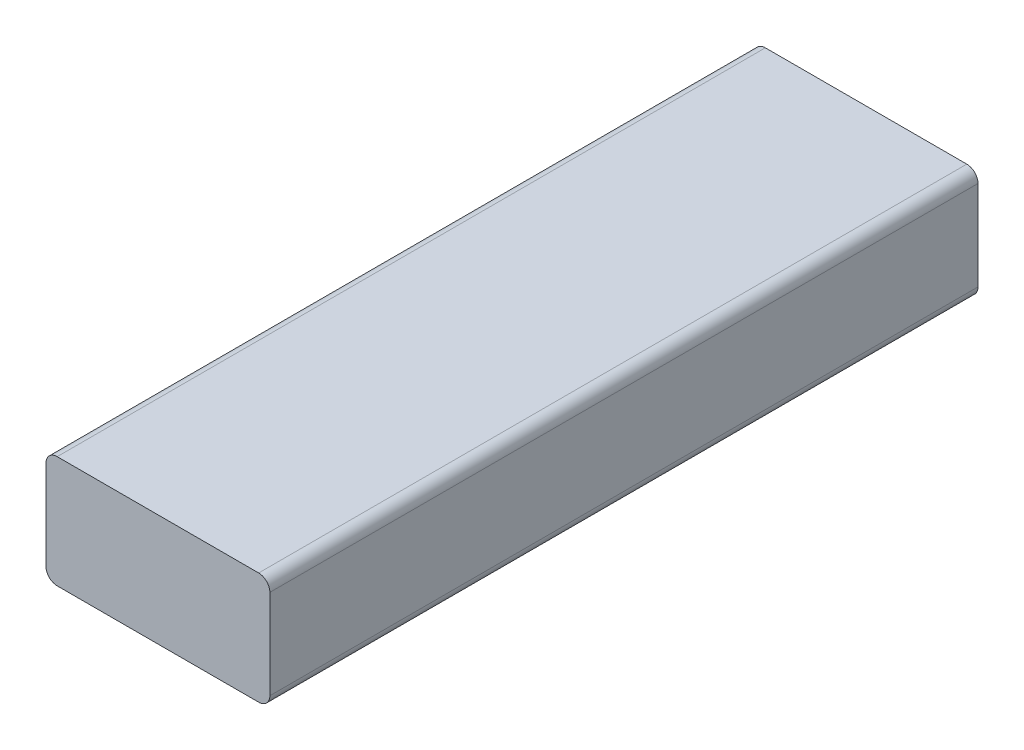
ISO-10303-21;
HEADER;
FILE_DESCRIPTION(('STEP AP214'),'2;1');
FILE_NAME('part.step','',(''),(''),'','','');
FILE_SCHEMA(('AUTOMOTIVE_DESIGN { 1 0 10303 214 1 1 1 1 }'));
ENDSEC;
DATA;
#1=APPLICATION_CONTEXT('core data for automotive mechanical design processes');
#2=APPLICATION_PROTOCOL_DEFINITION('international standard','automotive_design',2000,#1);
#3=PRODUCT_CONTEXT('',#1,'mechanical');
#4=PRODUCT('Part','Part','',(#3));
#5=PRODUCT_RELATED_PRODUCT_CATEGORY('part','',(#4));
#6=PRODUCT_DEFINITION_FORMATION('','',#4);
#7=PRODUCT_DEFINITION_CONTEXT('part definition',#1,'design');
#8=PRODUCT_DEFINITION('design','',#6,#7);
#9=PRODUCT_DEFINITION_SHAPE('','',#8);
#10=(LENGTH_UNIT() NAMED_UNIT(*) SI_UNIT(.MILLI.,.METRE.));
#11=(NAMED_UNIT(*) PLANE_ANGLE_UNIT() SI_UNIT($,.RADIAN.));
#12=(NAMED_UNIT(*) SI_UNIT($,.STERADIAN.) SOLID_ANGLE_UNIT());
#13=UNCERTAINTY_MEASURE_WITH_UNIT(LENGTH_MEASURE(1.E-05),#10,'distance_accuracy_value','');
#14=(GEOMETRIC_REPRESENTATION_CONTEXT(3) GLOBAL_UNCERTAINTY_ASSIGNED_CONTEXT((#13)) GLOBAL_UNIT_ASSIGNED_CONTEXT((#10,
#11,#12)) REPRESENTATION_CONTEXT('',''));
#15=CARTESIAN_POINT('',(0.,0.,0.));
#16=DIRECTION('',(0.,0.,1.));
#17=DIRECTION('',(1.,0.,0.));
#18=AXIS2_PLACEMENT_3D('',#15,#16,#17);
#19=CARTESIAN_POINT('',(2587.29999999996,38.100000000002,-160.699999999997));
#20=DIRECTION('',(1.,0.,0.));
#21=DIRECTION('',(0.,1.,0.));
#22=AXIS2_PLACEMENT_3D('',#19,#20,#21);
#23=PLANE('',#22);
#24=DIRECTION('',(0.,-1.,0.));
#25=VECTOR('',#24,1.);
#26=CARTESIAN_POINT('',(2587.29999999996,38.1000000000078,160.700000000008));
#27=LINE('',#26,#25);
#28=CARTESIAN_POINT('',(2587.29999999996,33.0200000000078,160.700000000008));
#29=VERTEX_POINT('',#28);
#30=CARTESIAN_POINT('',(2587.29999999996,-7.61999999999216,160.700000000009));
#31=VERTEX_POINT('',#30);
#32=EDGE_CURVE('E158',#29,#31,#27,.T.);
#33=ORIENTED_EDGE('',*,*,#32,.T.);
#34=DIRECTION('',(0.,0.,1.));
#35=VECTOR('',#34,1.);
#36=CARTESIAN_POINT('',(2587.29999999996,-7.61999999999798,-160.699999999996));
#37=LINE('',#36,#35);
#38=CARTESIAN_POINT('',(2587.29999999996,-7.61999999999798,-160.699999999996));
#39=VERTEX_POINT('',#38);
#40=EDGE_CURVE('E113',#31,#39,#37,.F.);
#41=ORIENTED_EDGE('',*,*,#40,.T.);
#42=DIRECTION('',(0.,-1.,0.));
#43=VECTOR('',#42,1.);
#44=CARTESIAN_POINT('',(2587.29999999996,38.100000000002,-160.699999999997));
#45=LINE('',#44,#43);
#46=CARTESIAN_POINT('',(2587.29999999996,33.020000000002,-160.699999999996));
#47=VERTEX_POINT('',#46);
#48=EDGE_CURVE('E147',#47,#39,#45,.T.);
#49=ORIENTED_EDGE('',*,*,#48,.F.);
#50=DIRECTION('',(0.,0.,1.));
#51=VECTOR('',#50,1.);
#52=CARTESIAN_POINT('',(2587.29999999996,33.0200000000078,160.700000000008));
#53=LINE('',#52,#51);
#54=EDGE_CURVE('E119',#47,#29,#53,.T.);
#55=ORIENTED_EDGE('',*,*,#54,.T.);
#56=EDGE_LOOP('',(#33,#41,#49,#55));
#57=FACE_BOUND('',#56,.T.);
#58=ADVANCED_FACE('F43',(#57),#23,.T.);
#59=CARTESIAN_POINT('',(2587.29999999996,38.100000000002,-160.699999999997));
#60=DIRECTION('',(0.,0.,-1.));
#61=DIRECTION('',(0.,1.,0.));
#62=AXIS2_PLACEMENT_3D('',#59,#60,#61);
#63=PLANE('',#62);
#64=ORIENTED_EDGE('',*,*,#48,.T.);
#65=CARTESIAN_POINT('',(2582.21999999996,-7.619999999998,-160.699999999996));
#66=DIRECTION('',(0.,0.,-1.));
#67=DIRECTION('',(0.,1.,0.));
#68=AXIS2_PLACEMENT_3D('',#65,#66,#67);
#69=CIRCLE('',#68,5.08);
#70=CARTESIAN_POINT('',(2582.21999999996,-12.699999999998,-160.699999999996));
#71=VERTEX_POINT('',#70);
#72=EDGE_CURVE('E183',#39,#71,#69,.T.);
#73=ORIENTED_EDGE('',*,*,#72,.T.);
#74=DIRECTION('',(1.,0.,0.));
#75=VECTOR('',#74,1.);
#76=CARTESIAN_POINT('',(2587.29999999996,-12.699999999998,-160.699999999996));
#77=LINE('',#76,#75);
#78=CARTESIAN_POINT('',(2490.77999999996,-12.6999999999985,-160.699999999996));
#79=VERTEX_POINT('',#78);
#80=EDGE_CURVE('E130',#79,#71,#77,.T.);
#81=ORIENTED_EDGE('',*,*,#80,.F.);
#82=CARTESIAN_POINT('',(2490.77999999996,-7.61999999999848,-160.699999999996));
#83=DIRECTION('',(0.,0.,-1.));
#84=DIRECTION('',(0.,1.,0.));
#85=AXIS2_PLACEMENT_3D('',#82,#83,#84);
#86=CIRCLE('',#85,5.08);
#87=CARTESIAN_POINT('',(2485.69999999996,-7.6199999999985,-160.699999999996));
#88=VERTEX_POINT('',#87);
#89=EDGE_CURVE('E180',#79,#88,#86,.T.);
#90=ORIENTED_EDGE('',*,*,#89,.T.);
#91=DIRECTION('',(0.,-1.,0.));
#92=VECTOR('',#91,1.);
#93=CARTESIAN_POINT('',(2485.69999999996,38.1000000000015,-160.699999999997));
#94=LINE('',#93,#92);
#95=CARTESIAN_POINT('',(2485.69999999996,33.0200000000015,-160.699999999996));
#96=VERTEX_POINT('',#95);
#97=EDGE_CURVE('E151',#96,#88,#94,.T.);
#98=ORIENTED_EDGE('',*,*,#97,.F.);
#99=CARTESIAN_POINT('',(2490.77999999996,33.0200000000015,-160.699999999996));
#100=DIRECTION('',(0.,0.,-1.));
#101=DIRECTION('',(0.,1.,0.));
#102=AXIS2_PLACEMENT_3D('',#99,#100,#101);
#103=CIRCLE('',#102,5.08);
#104=CARTESIAN_POINT('',(2490.77999999996,38.1000000000015,-160.699999999997));
#105=VERTEX_POINT('',#104);
#106=EDGE_CURVE('E64',#96,#105,#103,.T.);
#107=ORIENTED_EDGE('',*,*,#106,.T.);
#108=DIRECTION('',(1.,0.,0.));
#109=VECTOR('',#108,1.);
#110=CARTESIAN_POINT('',(2587.29999999996,38.100000000002,-160.699999999997));
#111=LINE('',#110,#109);
#112=CARTESIAN_POINT('',(2582.21999999996,38.100000000002,-160.699999999997));
#113=VERTEX_POINT('',#112);
#114=EDGE_CURVE('E144',#105,#113,#111,.T.);
#115=ORIENTED_EDGE('',*,*,#114,.T.);
#116=CARTESIAN_POINT('',(2582.21999999996,33.020000000002,-160.699999999996));
#117=DIRECTION('',(0.,0.,-1.));
#118=DIRECTION('',(0.,1.,0.));
#119=AXIS2_PLACEMENT_3D('',#116,#117,#118);
#120=CIRCLE('',#119,5.08);
#121=EDGE_CURVE('E177',#113,#47,#120,.T.);
#122=ORIENTED_EDGE('',*,*,#121,.T.);
#123=EDGE_LOOP('',(#64,#73,#81,#90,#98,#107,#115,#122));
#124=FACE_BOUND('',#123,.T.);
#125=ADVANCED_FACE('F204',(#124),#63,.T.);
#126=CARTESIAN_POINT('',(2485.69999999996,38.1000000000015,-160.699999999997));
#127=DIRECTION('',(-1.,0.,0.));
#128=DIRECTION('',(0.,-1.,0.));
#129=AXIS2_PLACEMENT_3D('',#126,#127,#128);
#130=PLANE('',#129);
#131=ORIENTED_EDGE('',*,*,#97,.T.);
#132=DIRECTION('',(0.,0.,-1.));
#133=VECTOR('',#132,1.);
#134=CARTESIAN_POINT('',(2485.69999999996,-7.6199999999985,-160.699999999996));
#135=LINE('',#134,#133);
#136=CARTESIAN_POINT('',(2485.69999999996,-7.61999999999269,160.700000000009));
#137=VERTEX_POINT('',#136);
#138=EDGE_CURVE('E190',#88,#137,#135,.F.);
#139=ORIENTED_EDGE('',*,*,#138,.T.);
#140=DIRECTION('',(0.,-1.,0.));
#141=VECTOR('',#140,1.);
#142=CARTESIAN_POINT('',(2485.69999999996,38.1000000000073,160.700000000008));
#143=LINE('',#142,#141);
#144=CARTESIAN_POINT('',(2485.69999999996,33.0200000000073,160.700000000008));
#145=VERTEX_POINT('',#144);
#146=EDGE_CURVE('E155',#145,#137,#143,.T.);
#147=ORIENTED_EDGE('',*,*,#146,.F.);
#148=DIRECTION('',(0.,0.,-1.));
#149=VECTOR('',#148,1.);
#150=CARTESIAN_POINT('',(2485.69999999996,33.0200000000015,-160.699999999996));
#151=LINE('',#150,#149);
#152=EDGE_CURVE('E186',#145,#96,#151,.T.);
#153=ORIENTED_EDGE('',*,*,#152,.T.);
#154=EDGE_LOOP('',(#131,#139,#147,#153));
#155=FACE_BOUND('',#154,.T.);
#156=ADVANCED_FACE('F202',(#155),#130,.T.);
#157=CARTESIAN_POINT('',(2587.29999999996,38.1000000000078,160.700000000008));
#158=DIRECTION('',(0.,0.,1.));
#159=DIRECTION('',(0.,-1.,0.));
#160=AXIS2_PLACEMENT_3D('',#157,#158,#159);
#161=PLANE('',#160);
#162=DIRECTION('',(-1.,0.,0.));
#163=VECTOR('',#162,1.);
#164=CARTESIAN_POINT('',(2587.29999999996,-12.6999999999922,160.700000000009));
#165=LINE('',#164,#163);
#166=CARTESIAN_POINT('',(2582.21999999996,-12.6999999999922,160.700000000009));
#167=VERTEX_POINT('',#166);
#168=CARTESIAN_POINT('',(2490.77999999996,-12.6999999999927,160.700000000009));
#169=VERTEX_POINT('',#168);
#170=EDGE_CURVE('E127',#167,#169,#165,.T.);
#171=ORIENTED_EDGE('',*,*,#170,.F.);
#172=CARTESIAN_POINT('',(2582.21999999996,-7.61999999999219,160.700000000009));
#173=DIRECTION('',(0.,0.,1.));
#174=DIRECTION('',(0.,-1.,0.));
#175=AXIS2_PLACEMENT_3D('',#172,#173,#174);
#176=CIRCLE('',#175,5.08);
#177=EDGE_CURVE('E108',#167,#31,#176,.T.);
#178=ORIENTED_EDGE('',*,*,#177,.T.);
#179=ORIENTED_EDGE('',*,*,#32,.F.);
#180=CARTESIAN_POINT('',(2582.21999999996,33.0200000000078,160.700000000008));
#181=DIRECTION('',(0.,0.,1.));
#182=DIRECTION('',(0.,-1.,0.));
#183=AXIS2_PLACEMENT_3D('',#180,#181,#182);
#184=CIRCLE('',#183,5.08);
#185=CARTESIAN_POINT('',(2582.21999999996,38.1000000000078,160.700000000008));
#186=VERTEX_POINT('',#185);
#187=EDGE_CURVE('E165',#29,#186,#184,.T.);
#188=ORIENTED_EDGE('',*,*,#187,.T.);
#189=DIRECTION('',(-1.,0.,0.));
#190=VECTOR('',#189,1.);
#191=CARTESIAN_POINT('',(2587.29999999996,38.1000000000078,160.700000000008));
#192=LINE('',#191,#190);
#193=CARTESIAN_POINT('',(2490.77999999996,38.1000000000073,160.700000000008));
#194=VERTEX_POINT('',#193);
#195=EDGE_CURVE('E141',#186,#194,#192,.T.);
#196=ORIENTED_EDGE('',*,*,#195,.T.);
#197=CARTESIAN_POINT('',(2490.77999999996,33.0200000000073,160.700000000008));
#198=DIRECTION('',(0.,0.,1.));
#199=DIRECTION('',(0.,-1.,0.));
#200=AXIS2_PLACEMENT_3D('',#197,#198,#199);
#201=CIRCLE('',#200,5.08);
#202=EDGE_CURVE('E132',#194,#145,#201,.T.);
#203=ORIENTED_EDGE('',*,*,#202,.T.);
#204=ORIENTED_EDGE('',*,*,#146,.T.);
#205=CARTESIAN_POINT('',(2490.77999999996,-7.61999999999266,160.700000000009));
#206=DIRECTION('',(0.,0.,1.));
#207=DIRECTION('',(0.,-1.,0.));
#208=AXIS2_PLACEMENT_3D('',#205,#206,#207);
#209=CIRCLE('',#208,5.08);
#210=EDGE_CURVE('E120',#137,#169,#209,.T.);
#211=ORIENTED_EDGE('',*,*,#210,.T.);
#212=EDGE_LOOP('',(#171,#178,#179,#188,#196,#203,#204,#211));
#213=FACE_BOUND('',#212,.T.);
#214=ADVANCED_FACE('F135',(#213),#161,.T.);
#215=CARTESIAN_POINT('',(-1.99258099982953E-13,38.0999999999914,-6.88849415960972E-13));
#216=DIRECTION('',(0.,-1.,0.));
#217=DIRECTION('',(0.,0.,-1.));
#218=AXIS2_PLACEMENT_3D('',#215,#216,#217);
#219=PLANE('',#218);
#220=ORIENTED_EDGE('',*,*,#195,.F.);
#221=DIRECTION('',(0.,0.,1.));
#222=VECTOR('',#221,1.);
#223=CARTESIAN_POINT('',(2582.21999999996,38.100000000002,-160.699999999997));
#224=LINE('',#223,#222);
#225=EDGE_CURVE('E11',#186,#113,#224,.F.);
#226=ORIENTED_EDGE('',*,*,#225,.T.);
#227=ORIENTED_EDGE('',*,*,#114,.F.);
#228=DIRECTION('',(0.,0.,-1.));
#229=VECTOR('',#228,1.);
#230=CARTESIAN_POINT('',(2490.77999999996,38.1000000000073,160.700000000008));
#231=LINE('',#230,#229);
#232=EDGE_CURVE('E52',#105,#194,#231,.F.);
#233=ORIENTED_EDGE('',*,*,#232,.T.);
#234=EDGE_LOOP('',(#220,#226,#227,#233));
#235=FACE_BOUND('',#234,.T.);
#236=ADVANCED_FACE('F195',(#235),#219,.F.);
#237=CARTESIAN_POINT('',(0.,-12.7000000000086,2.29632265978476E-13));
#238=DIRECTION('',(0.,-1.,0.));
#239=DIRECTION('',(0.,0.,-1.));
#240=AXIS2_PLACEMENT_3D('',#237,#238,#239);
#241=PLANE('',#240);
#242=ORIENTED_EDGE('',*,*,#80,.T.);
#243=DIRECTION('',(0.,0.,1.));
#244=VECTOR('',#243,1.);
#245=CARTESIAN_POINT('',(2582.21999999996,-12.6999999999951,2.29632265978232E-13));
#246=LINE('',#245,#244);
#247=EDGE_CURVE('E112',#71,#167,#246,.T.);
#248=ORIENTED_EDGE('',*,*,#247,.T.);
#249=ORIENTED_EDGE('',*,*,#170,.T.);
#250=DIRECTION('',(0.,0.,-1.));
#251=VECTOR('',#250,1.);
#252=CARTESIAN_POINT('',(2490.77999999996,-12.6999999999956,2.29632265978241E-13));
#253=LINE('',#252,#251);
#254=EDGE_CURVE('E133',#169,#79,#253,.T.);
#255=ORIENTED_EDGE('',*,*,#254,.T.);
#256=EDGE_LOOP('',(#242,#248,#249,#255));
#257=FACE_BOUND('',#256,.T.);
#258=ADVANCED_FACE('F125',(#257),#241,.T.);
#259=CARTESIAN_POINT('',(2582.21999999996,-7.61999999999509,1.37779359586904E-13));
#260=DIRECTION('',(0.,0.,1.));
#261=DIRECTION('',(0.,-1.,0.));
#262=AXIS2_PLACEMENT_3D('',#259,#260,#261);
#263=CYLINDRICAL_SURFACE('',#262,5.08);
#264=ORIENTED_EDGE('',*,*,#72,.F.);
#265=ORIENTED_EDGE('',*,*,#40,.F.);
#266=ORIENTED_EDGE('',*,*,#177,.F.);
#267=ORIENTED_EDGE('',*,*,#247,.F.);
#268=EDGE_LOOP('',(#264,#265,#266,#267));
#269=FACE_BOUND('',#268,.T.);
#270=ADVANCED_FACE('F111',(#269),#263,.T.);
#271=CARTESIAN_POINT('',(2490.77999999996,-7.61999999999557,1.37779359586912E-13));
#272=DIRECTION('',(0.,0.,-1.));
#273=DIRECTION('',(0.,1.,0.));
#274=AXIS2_PLACEMENT_3D('',#271,#272,#273);
#275=CYLINDRICAL_SURFACE('',#274,5.08);
#276=ORIENTED_EDGE('',*,*,#210,.F.);
#277=ORIENTED_EDGE('',*,*,#138,.F.);
#278=ORIENTED_EDGE('',*,*,#89,.F.);
#279=ORIENTED_EDGE('',*,*,#254,.F.);
#280=EDGE_LOOP('',(#276,#277,#278,#279));
#281=FACE_BOUND('',#280,.T.);
#282=ADVANCED_FACE('F206',(#281),#275,.T.);
#283=CARTESIAN_POINT('',(2582.21999999996,33.020000000002,-160.699999999996));
#284=DIRECTION('',(0.,0.,-1.));
#285=DIRECTION('',(0.,1.,0.));
#286=AXIS2_PLACEMENT_3D('',#283,#284,#285);
#287=CYLINDRICAL_SURFACE('',#286,5.08);
#288=ORIENTED_EDGE('',*,*,#121,.F.);
#289=ORIENTED_EDGE('',*,*,#225,.F.);
#290=ORIENTED_EDGE('',*,*,#187,.F.);
#291=ORIENTED_EDGE('',*,*,#54,.F.);
#292=EDGE_LOOP('',(#288,#289,#290,#291));
#293=FACE_BOUND('',#292,.T.);
#294=ADVANCED_FACE('F208',(#293),#287,.T.);
#295=CARTESIAN_POINT('',(2490.77999999996,33.0200000000015,-160.699999999996));
#296=DIRECTION('',(0.,0.,1.));
#297=DIRECTION('',(0.,-1.,0.));
#298=AXIS2_PLACEMENT_3D('',#295,#296,#297);
#299=CYLINDRICAL_SURFACE('',#298,5.08);
#300=ORIENTED_EDGE('',*,*,#202,.F.);
#301=ORIENTED_EDGE('',*,*,#232,.F.);
#302=ORIENTED_EDGE('',*,*,#106,.F.);
#303=ORIENTED_EDGE('',*,*,#152,.F.);
#304=EDGE_LOOP('',(#300,#301,#302,#303));
#305=FACE_BOUND('',#304,.T.);
#306=ADVANCED_FACE('F45',(#305),#299,.T.);
#307=CLOSED_SHELL('',(#58,#125,#156,#214,#236,#258,#270,#282,#294,#306));
#308=MANIFOLD_SOLID_BREP('B2',#307);
#309=ADVANCED_BREP_SHAPE_REPRESENTATION('',(#18,#308),#14);
#310=SHAPE_DEFINITION_REPRESENTATION(#9,#309);
ENDSEC;
END-ISO-10303-21;
